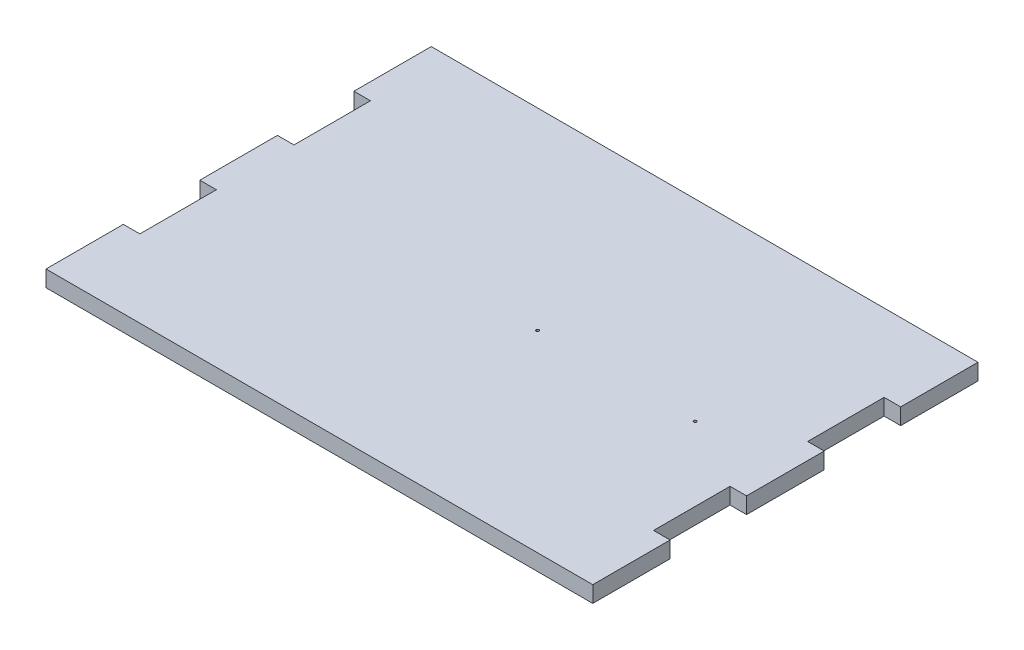
ISO-10303-21;
HEADER;
FILE_DESCRIPTION(('STEP AP214'),'2;1');
FILE_NAME('part.step','',(''),(''),'','','');
FILE_SCHEMA(('AUTOMOTIVE_DESIGN { 1 0 10303 214 1 1 1 1 }'));
ENDSEC;
DATA;
#1=APPLICATION_CONTEXT('core data for automotive mechanical design processes');
#2=APPLICATION_PROTOCOL_DEFINITION('international standard','automotive_design',2000,#1);
#3=PRODUCT_CONTEXT('',#1,'mechanical');
#4=PRODUCT('Part','Part','',(#3));
#5=PRODUCT_RELATED_PRODUCT_CATEGORY('part','',(#4));
#6=PRODUCT_DEFINITION_FORMATION('','',#4);
#7=PRODUCT_DEFINITION_CONTEXT('part definition',#1,'design');
#8=PRODUCT_DEFINITION('design','',#6,#7);
#9=PRODUCT_DEFINITION_SHAPE('','',#8);
#10=(LENGTH_UNIT() NAMED_UNIT(*) SI_UNIT(.MILLI.,.METRE.));
#11=(NAMED_UNIT(*) PLANE_ANGLE_UNIT() SI_UNIT($,.RADIAN.));
#12=(NAMED_UNIT(*) SI_UNIT($,.STERADIAN.) SOLID_ANGLE_UNIT());
#13=UNCERTAINTY_MEASURE_WITH_UNIT(LENGTH_MEASURE(1.E-05),#10,'distance_accuracy_value','');
#14=(GEOMETRIC_REPRESENTATION_CONTEXT(3) GLOBAL_UNCERTAINTY_ASSIGNED_CONTEXT((#13)) GLOBAL_UNIT_ASSIGNED_CONTEXT((#10,
#11,#12)) REPRESENTATION_CONTEXT('',''));
#15=CARTESIAN_POINT('',(0.,0.,0.));
#16=DIRECTION('',(0.,0.,1.));
#17=DIRECTION('',(1.,0.,0.));
#18=AXIS2_PLACEMENT_3D('',#15,#16,#17);
#19=CARTESIAN_POINT('',(-6.,5.7,14.));
#20=DIRECTION('',(0.,0.,-1.));
#21=DIRECTION('',(-1.,0.,0.));
#22=AXIS2_PLACEMENT_3D('',#19,#20,#21);
#23=PLANE('',#22);
#24=DIRECTION('',(0.,-1.,0.));
#25=VECTOR('',#24,1.);
#26=CARTESIAN_POINT('',(185.8,22.,14.));
#27=LINE('',#26,#25);
#28=CARTESIAN_POINT('',(185.8,5.7,14.));
#29=VERTEX_POINT('',#28);
#30=CARTESIAN_POINT('',(185.8,0.,14.));
#31=VERTEX_POINT('',#30);
#32=EDGE_CURVE('E49',#29,#31,#27,.T.);
#33=ORIENTED_EDGE('',*,*,#32,.F.);
#34=DIRECTION('',(1.,0.,0.));
#35=VECTOR('',#34,1.);
#36=CARTESIAN_POINT('',(-6.,5.7,14.));
#37=LINE('',#36,#35);
#38=CARTESIAN_POINT('',(-5.8,5.7,14.));
#39=VERTEX_POINT('',#38);
#40=EDGE_CURVE('E41',#39,#29,#37,.T.);
#41=ORIENTED_EDGE('',*,*,#40,.F.);
#42=DIRECTION('',(0.,-1.,0.));
#43=VECTOR('',#42,1.);
#44=CARTESIAN_POINT('',(-5.8,22.,14.));
#45=LINE('',#44,#43);
#46=CARTESIAN_POINT('',(-5.8,0.,14.));
#47=VERTEX_POINT('',#46);
#48=EDGE_CURVE('E230',#39,#47,#45,.T.);
#49=ORIENTED_EDGE('',*,*,#48,.T.);
#50=DIRECTION('',(1.,0.,0.));
#51=VECTOR('',#50,1.);
#52=CARTESIAN_POINT('',(-6.,0.,14.));
#53=LINE('',#52,#51);
#54=EDGE_CURVE('E191',#47,#31,#53,.T.);
#55=ORIENTED_EDGE('',*,*,#54,.T.);
#56=EDGE_LOOP('',(#33,#41,#49,#55));
#57=FACE_BOUND('',#56,.T.);
#58=ADVANCED_FACE('F33',(#57),#23,.F.);
#59=CARTESIAN_POINT('',(-6.,5.7,-121.));
#60=DIRECTION('',(0.,0.,1.));
#61=DIRECTION('',(1.,0.,0.));
#62=AXIS2_PLACEMENT_3D('',#59,#60,#61);
#63=PLANE('',#62);
#64=DIRECTION('',(0.,-1.,0.));
#65=VECTOR('',#64,1.);
#66=CARTESIAN_POINT('',(185.8,22.,-121.));
#67=LINE('',#66,#65);
#68=CARTESIAN_POINT('',(185.8,5.7,-121.));
#69=VERTEX_POINT('',#68);
#70=CARTESIAN_POINT('',(185.8,0.,-121.));
#71=VERTEX_POINT('',#70);
#72=EDGE_CURVE('E173',#69,#71,#67,.T.);
#73=ORIENTED_EDGE('',*,*,#72,.T.);
#74=DIRECTION('',(-1.,0.,0.));
#75=VECTOR('',#74,1.);
#76=CARTESIAN_POINT('',(-6.,0.,-121.));
#77=LINE('',#76,#75);
#78=CARTESIAN_POINT('',(-5.8,0.,-121.));
#79=VERTEX_POINT('',#78);
#80=EDGE_CURVE('E36',#71,#79,#77,.T.);
#81=ORIENTED_EDGE('',*,*,#80,.T.);
#82=DIRECTION('',(0.,-1.,0.));
#83=VECTOR('',#82,1.);
#84=CARTESIAN_POINT('',(-5.8,22.,-121.));
#85=LINE('',#84,#83);
#86=CARTESIAN_POINT('',(-5.8,5.7,-121.));
#87=VERTEX_POINT('',#86);
#88=EDGE_CURVE('E248',#87,#79,#85,.T.);
#89=ORIENTED_EDGE('',*,*,#88,.F.);
#90=DIRECTION('',(-1.,0.,0.));
#91=VECTOR('',#90,1.);
#92=CARTESIAN_POINT('',(-6.,5.7,-121.));
#93=LINE('',#92,#91);
#94=EDGE_CURVE('E11',#69,#87,#93,.T.);
#95=ORIENTED_EDGE('',*,*,#94,.F.);
#96=EDGE_LOOP('',(#73,#81,#89,#95));
#97=FACE_BOUND('',#96,.T.);
#98=ADVANCED_FACE('F183',(#97),#63,.F.);
#99=CARTESIAN_POINT('',(0.,5.7,0.));
#100=DIRECTION('',(0.,-1.,0.));
#101=DIRECTION('',(0.,0.,-1.));
#102=AXIS2_PLACEMENT_3D('',#99,#100,#101);
#103=PLANE('',#102);
#104=CARTESIAN_POINT('',(154.2,5.7,-53.5));
#105=DIRECTION('',(0.,-1.,0.));
#106=DIRECTION('',(0.,0.,-1.));
#107=AXIS2_PLACEMENT_3D('',#104,#105,#106);
#108=CIRCLE('',#107,0.499999999999999);
#109=CARTESIAN_POINT('',(154.2,5.7,-54.));
#110=VERTEX_POINT('',#109);
#111=EDGE_CURVE('E205',#110,#110,#108,.F.);
#112=ORIENTED_EDGE('',*,*,#111,.F.);
#113=EDGE_LOOP('',(#112));
#114=FACE_BOUND('',#113,.T.);
#115=CARTESIAN_POINT('',(99.,5.7,-53.5));
#116=DIRECTION('',(0.,-1.,0.));
#117=DIRECTION('',(0.,0.,-1.));
#118=AXIS2_PLACEMENT_3D('',#115,#116,#117);
#119=CIRCLE('',#118,0.499999999999999);
#120=CARTESIAN_POINT('',(99.,5.7,-54.));
#121=VERTEX_POINT('',#120);
#122=EDGE_CURVE('E195',#121,#121,#119,.F.);
#123=ORIENTED_EDGE('',*,*,#122,.F.);
#124=EDGE_LOOP('',(#123));
#125=FACE_BOUND('',#124,.T.);
#126=DIRECTION('',(0.,0.,1.));
#127=VECTOR('',#126,1.);
#128=CARTESIAN_POINT('',(185.8,5.7,0.));
#129=LINE('',#128,#127);
#130=CARTESIAN_POINT('',(185.8,5.7,-93.9));
#131=VERTEX_POINT('',#130);
#132=EDGE_CURVE('E274',#69,#131,#129,.T.);
#133=ORIENTED_EDGE('',*,*,#132,.F.);
#134=ORIENTED_EDGE('',*,*,#94,.T.);
#135=DIRECTION('',(0.,0.,-1.));
#136=VECTOR('',#135,1.);
#137=CARTESIAN_POINT('',(-5.8,5.7,0.));
#138=LINE('',#137,#136);
#139=CARTESIAN_POINT('',(-5.8,5.7,-93.9));
#140=VERTEX_POINT('',#139);
#141=EDGE_CURVE('E227',#140,#87,#138,.T.);
#142=ORIENTED_EDGE('',*,*,#141,.F.);
#143=DIRECTION('',(-1.,0.,0.));
#144=VECTOR('',#143,1.);
#145=CARTESIAN_POINT('',(0.,5.7,-93.9));
#146=LINE('',#145,#144);
#147=CARTESIAN_POINT('',(0.,5.7,-93.9));
#148=VERTEX_POINT('',#147);
#149=EDGE_CURVE('E225',#148,#140,#146,.T.);
#150=ORIENTED_EDGE('',*,*,#149,.F.);
#151=DIRECTION('',(0.,0.,-1.));
#152=VECTOR('',#151,1.);
#153=CARTESIAN_POINT('',(0.,5.7,0.));
#154=LINE('',#153,#152);
#155=CARTESIAN_POINT('',(0.,5.7,-67.1));
#156=VERTEX_POINT('',#155);
#157=EDGE_CURVE('E223',#156,#148,#154,.T.);
#158=ORIENTED_EDGE('',*,*,#157,.F.);
#159=DIRECTION('',(1.,0.,0.));
#160=VECTOR('',#159,1.);
#161=CARTESIAN_POINT('',(0.,5.7,-67.1));
#162=LINE('',#161,#160);
#163=CARTESIAN_POINT('',(-5.8,5.7,-67.1));
#164=VERTEX_POINT('',#163);
#165=EDGE_CURVE('E221',#164,#156,#162,.T.);
#166=ORIENTED_EDGE('',*,*,#165,.F.);
#167=DIRECTION('',(0.,0.,-1.));
#168=VECTOR('',#167,1.);
#169=CARTESIAN_POINT('',(-5.8,5.7,0.));
#170=LINE('',#169,#168);
#171=CARTESIAN_POINT('',(-5.8,5.7,-39.9));
#172=VERTEX_POINT('',#171);
#173=EDGE_CURVE('E219',#172,#164,#170,.T.);
#174=ORIENTED_EDGE('',*,*,#173,.F.);
#175=DIRECTION('',(-1.,0.,0.));
#176=VECTOR('',#175,1.);
#177=CARTESIAN_POINT('',(0.,5.7,-39.9));
#178=LINE('',#177,#176);
#179=CARTESIAN_POINT('',(0.,5.7,-39.9));
#180=VERTEX_POINT('',#179);
#181=EDGE_CURVE('E217',#180,#172,#178,.T.);
#182=ORIENTED_EDGE('',*,*,#181,.F.);
#183=DIRECTION('',(0.,0.,-1.));
#184=VECTOR('',#183,1.);
#185=CARTESIAN_POINT('',(0.,5.7,0.));
#186=LINE('',#185,#184);
#187=CARTESIAN_POINT('',(0.,5.7,-13.1));
#188=VERTEX_POINT('',#187);
#189=EDGE_CURVE('E215',#188,#180,#186,.T.);
#190=ORIENTED_EDGE('',*,*,#189,.F.);
#191=DIRECTION('',(1.,0.,0.));
#192=VECTOR('',#191,1.);
#193=CARTESIAN_POINT('',(0.,5.7,-13.1));
#194=LINE('',#193,#192);
#195=CARTESIAN_POINT('',(-5.8,5.7,-13.1));
#196=VERTEX_POINT('',#195);
#197=EDGE_CURVE('E213',#196,#188,#194,.T.);
#198=ORIENTED_EDGE('',*,*,#197,.F.);
#199=DIRECTION('',(0.,0.,-1.));
#200=VECTOR('',#199,1.);
#201=CARTESIAN_POINT('',(-5.8,5.7,0.));
#202=LINE('',#201,#200);
#203=EDGE_CURVE('E211',#39,#196,#202,.T.);
#204=ORIENTED_EDGE('',*,*,#203,.F.);
#205=ORIENTED_EDGE('',*,*,#40,.T.);
#206=DIRECTION('',(0.,0.,1.));
#207=VECTOR('',#206,1.);
#208=CARTESIAN_POINT('',(185.8,5.7,0.));
#209=LINE('',#208,#207);
#210=CARTESIAN_POINT('',(185.8,5.7,-13.1));
#211=VERTEX_POINT('',#210);
#212=EDGE_CURVE('E184',#211,#29,#209,.T.);
#213=ORIENTED_EDGE('',*,*,#212,.F.);
#214=DIRECTION('',(1.,0.,0.));
#215=VECTOR('',#214,1.);
#216=CARTESIAN_POINT('',(0.,5.7,-13.1));
#217=LINE('',#216,#215);
#218=CARTESIAN_POINT('',(180.,5.7,-13.1));
#219=VERTEX_POINT('',#218);
#220=EDGE_CURVE('E288',#219,#211,#217,.T.);
#221=ORIENTED_EDGE('',*,*,#220,.F.);
#222=DIRECTION('',(0.,0.,1.));
#223=VECTOR('',#222,1.);
#224=CARTESIAN_POINT('',(180.,5.7,0.));
#225=LINE('',#224,#223);
#226=CARTESIAN_POINT('',(180.,5.7,-39.9));
#227=VERTEX_POINT('',#226);
#228=EDGE_CURVE('E286',#227,#219,#225,.T.);
#229=ORIENTED_EDGE('',*,*,#228,.F.);
#230=DIRECTION('',(-1.,0.,0.));
#231=VECTOR('',#230,1.);
#232=CARTESIAN_POINT('',(0.,5.7,-39.9));
#233=LINE('',#232,#231);
#234=CARTESIAN_POINT('',(185.8,5.7,-39.9));
#235=VERTEX_POINT('',#234);
#236=EDGE_CURVE('E284',#235,#227,#233,.T.);
#237=ORIENTED_EDGE('',*,*,#236,.F.);
#238=DIRECTION('',(0.,0.,1.));
#239=VECTOR('',#238,1.);
#240=CARTESIAN_POINT('',(185.8,5.7,0.));
#241=LINE('',#240,#239);
#242=CARTESIAN_POINT('',(185.8,5.7,-67.1));
#243=VERTEX_POINT('',#242);
#244=EDGE_CURVE('E282',#243,#235,#241,.T.);
#245=ORIENTED_EDGE('',*,*,#244,.F.);
#246=DIRECTION('',(1.,0.,0.));
#247=VECTOR('',#246,1.);
#248=CARTESIAN_POINT('',(0.,5.7,-67.1));
#249=LINE('',#248,#247);
#250=CARTESIAN_POINT('',(180.,5.7,-67.1));
#251=VERTEX_POINT('',#250);
#252=EDGE_CURVE('E280',#251,#243,#249,.T.);
#253=ORIENTED_EDGE('',*,*,#252,.F.);
#254=DIRECTION('',(0.,0.,1.));
#255=VECTOR('',#254,1.);
#256=CARTESIAN_POINT('',(180.,5.7,-1.86418045179597E-13));
#257=LINE('',#256,#255);
#258=CARTESIAN_POINT('',(180.,5.7,-93.9));
#259=VERTEX_POINT('',#258);
#260=EDGE_CURVE('E278',#259,#251,#257,.T.);
#261=ORIENTED_EDGE('',*,*,#260,.F.);
#262=DIRECTION('',(-1.,0.,0.));
#263=VECTOR('',#262,1.);
#264=CARTESIAN_POINT('',(0.,5.7,-93.9));
#265=LINE('',#264,#263);
#266=EDGE_CURVE('E276',#131,#259,#265,.T.);
#267=ORIENTED_EDGE('',*,*,#266,.F.);
#268=EDGE_LOOP('',(#133,#134,#142,#150,#158,#166,#174,#182,#190,#198,#204,#205,#213,#221,#229,
#237,#245,#253,#261,#267));
#269=FACE_BOUND('',#268,.T.);
#270=ADVANCED_FACE('F373',(#114,#125,#269),#103,.F.);
#271=CARTESIAN_POINT('',(0.,0.,0.));
#272=DIRECTION('',(0.,-1.,0.));
#273=DIRECTION('',(0.,0.,-1.));
#274=AXIS2_PLACEMENT_3D('',#271,#272,#273);
#275=PLANE('',#274);
#276=CARTESIAN_POINT('',(154.2,0.,-53.5));
#277=DIRECTION('',(0.,1.,0.));
#278=DIRECTION('',(0.,0.,1.));
#279=AXIS2_PLACEMENT_3D('',#276,#277,#278);
#280=CIRCLE('',#279,0.499999999999999);
#281=CARTESIAN_POINT('',(154.2,0.,-53.));
#282=VERTEX_POINT('',#281);
#283=EDGE_CURVE('E208',#282,#282,#280,.T.);
#284=ORIENTED_EDGE('',*,*,#283,.T.);
#285=EDGE_LOOP('',(#284));
#286=FACE_BOUND('',#285,.T.);
#287=CARTESIAN_POINT('',(99.,0.,-53.5));
#288=DIRECTION('',(0.,1.,0.));
#289=DIRECTION('',(0.,0.,1.));
#290=AXIS2_PLACEMENT_3D('',#287,#288,#289);
#291=CIRCLE('',#290,0.499999999999999);
#292=CARTESIAN_POINT('',(99.,0.,-53.));
#293=VERTEX_POINT('',#292);
#294=EDGE_CURVE('E200',#293,#293,#291,.T.);
#295=ORIENTED_EDGE('',*,*,#294,.T.);
#296=EDGE_LOOP('',(#295));
#297=FACE_BOUND('',#296,.T.);
#298=ORIENTED_EDGE('',*,*,#80,.F.);
#299=DIRECTION('',(0.,0.,1.));
#300=VECTOR('',#299,1.);
#301=CARTESIAN_POINT('',(185.8,0.,-121.));
#302=LINE('',#301,#300);
#303=CARTESIAN_POINT('',(185.8,0.,-93.9));
#304=VERTEX_POINT('',#303);
#305=EDGE_CURVE('E171',#71,#304,#302,.T.);
#306=ORIENTED_EDGE('',*,*,#305,.T.);
#307=DIRECTION('',(-1.,0.,0.));
#308=VECTOR('',#307,1.);
#309=CARTESIAN_POINT('',(185.8,0.,-93.9));
#310=LINE('',#309,#308);
#311=CARTESIAN_POINT('',(180.,0.,-93.9));
#312=VERTEX_POINT('',#311);
#313=EDGE_CURVE('E180',#304,#312,#310,.T.);
#314=ORIENTED_EDGE('',*,*,#313,.T.);
#315=DIRECTION('',(0.,0.,1.));
#316=VECTOR('',#315,1.);
#317=CARTESIAN_POINT('',(180.,0.,-93.9));
#318=LINE('',#317,#316);
#319=CARTESIAN_POINT('',(180.,0.,-67.1));
#320=VERTEX_POINT('',#319);
#321=EDGE_CURVE('E324',#312,#320,#318,.T.);
#322=ORIENTED_EDGE('',*,*,#321,.T.);
#323=DIRECTION('',(1.,0.,0.));
#324=VECTOR('',#323,1.);
#325=CARTESIAN_POINT('',(180.,0.,-67.1));
#326=LINE('',#325,#324);
#327=CARTESIAN_POINT('',(185.8,0.,-67.1));
#328=VERTEX_POINT('',#327);
#329=EDGE_CURVE('E321',#320,#328,#326,.T.);
#330=ORIENTED_EDGE('',*,*,#329,.T.);
#331=DIRECTION('',(0.,0.,1.));
#332=VECTOR('',#331,1.);
#333=CARTESIAN_POINT('',(185.8,0.,-67.1));
#334=LINE('',#333,#332);
#335=CARTESIAN_POINT('',(185.8,0.,-39.9));
#336=VERTEX_POINT('',#335);
#337=EDGE_CURVE('E318',#328,#336,#334,.T.);
#338=ORIENTED_EDGE('',*,*,#337,.T.);
#339=DIRECTION('',(-1.,0.,0.));
#340=VECTOR('',#339,1.);
#341=CARTESIAN_POINT('',(185.8,0.,-39.9));
#342=LINE('',#341,#340);
#343=CARTESIAN_POINT('',(180.,0.,-39.9));
#344=VERTEX_POINT('',#343);
#345=EDGE_CURVE('E315',#336,#344,#342,.T.);
#346=ORIENTED_EDGE('',*,*,#345,.T.);
#347=DIRECTION('',(0.,0.,1.));
#348=VECTOR('',#347,1.);
#349=CARTESIAN_POINT('',(180.,0.,-39.9));
#350=LINE('',#349,#348);
#351=CARTESIAN_POINT('',(180.,0.,-13.1));
#352=VERTEX_POINT('',#351);
#353=EDGE_CURVE('E312',#344,#352,#350,.T.);
#354=ORIENTED_EDGE('',*,*,#353,.T.);
#355=DIRECTION('',(1.,0.,0.));
#356=VECTOR('',#355,1.);
#357=CARTESIAN_POINT('',(180.,0.,-13.1));
#358=LINE('',#357,#356);
#359=CARTESIAN_POINT('',(185.8,0.,-13.1));
#360=VERTEX_POINT('',#359);
#361=EDGE_CURVE('E309',#352,#360,#358,.T.);
#362=ORIENTED_EDGE('',*,*,#361,.T.);
#363=DIRECTION('',(0.,0.,1.));
#364=VECTOR('',#363,1.);
#365=CARTESIAN_POINT('',(185.8,0.,-13.1));
#366=LINE('',#365,#364);
#367=EDGE_CURVE('E307',#360,#31,#366,.T.);
#368=ORIENTED_EDGE('',*,*,#367,.T.);
#369=ORIENTED_EDGE('',*,*,#54,.F.);
#370=DIRECTION('',(0.,0.,-1.));
#371=VECTOR('',#370,1.);
#372=CARTESIAN_POINT('',(-5.8,0.,-13.1));
#373=LINE('',#372,#371);
#374=CARTESIAN_POINT('',(-5.8,0.,-13.1));
#375=VERTEX_POINT('',#374);
#376=EDGE_CURVE('E271',#47,#375,#373,.T.);
#377=ORIENTED_EDGE('',*,*,#376,.T.);
#378=DIRECTION('',(1.,0.,0.));
#379=VECTOR('',#378,1.);
#380=CARTESIAN_POINT('',(0.,0.,-13.1));
#381=LINE('',#380,#379);
#382=CARTESIAN_POINT('',(0.,0.,-13.1));
#383=VERTEX_POINT('',#382);
#384=EDGE_CURVE('E268',#375,#383,#381,.T.);
#385=ORIENTED_EDGE('',*,*,#384,.T.);
#386=DIRECTION('',(0.,0.,-1.));
#387=VECTOR('',#386,1.);
#388=CARTESIAN_POINT('',(0.,0.,-39.9));
#389=LINE('',#388,#387);
#390=CARTESIAN_POINT('',(0.,0.,-39.9));
#391=VERTEX_POINT('',#390);
#392=EDGE_CURVE('E265',#383,#391,#389,.T.);
#393=ORIENTED_EDGE('',*,*,#392,.T.);
#394=DIRECTION('',(-1.,0.,0.));
#395=VECTOR('',#394,1.);
#396=CARTESIAN_POINT('',(-5.8,0.,-39.9));
#397=LINE('',#396,#395);
#398=CARTESIAN_POINT('',(-5.8,0.,-39.9));
#399=VERTEX_POINT('',#398);
#400=EDGE_CURVE('E262',#391,#399,#397,.T.);
#401=ORIENTED_EDGE('',*,*,#400,.T.);
#402=DIRECTION('',(0.,0.,-1.));
#403=VECTOR('',#402,1.);
#404=CARTESIAN_POINT('',(-5.8,0.,-67.1));
#405=LINE('',#404,#403);
#406=CARTESIAN_POINT('',(-5.8,0.,-67.1));
#407=VERTEX_POINT('',#406);
#408=EDGE_CURVE('E259',#399,#407,#405,.T.);
#409=ORIENTED_EDGE('',*,*,#408,.T.);
#410=DIRECTION('',(1.,0.,0.));
#411=VECTOR('',#410,1.);
#412=CARTESIAN_POINT('',(0.,0.,-67.1));
#413=LINE('',#412,#411);
#414=CARTESIAN_POINT('',(0.,0.,-67.1));
#415=VERTEX_POINT('',#414);
#416=EDGE_CURVE('E256',#407,#415,#413,.T.);
#417=ORIENTED_EDGE('',*,*,#416,.T.);
#418=DIRECTION('',(0.,0.,-1.));
#419=VECTOR('',#418,1.);
#420=CARTESIAN_POINT('',(0.,0.,-93.9));
#421=LINE('',#420,#419);
#422=CARTESIAN_POINT('',(0.,0.,-93.9));
#423=VERTEX_POINT('',#422);
#424=EDGE_CURVE('E253',#415,#423,#421,.T.);
#425=ORIENTED_EDGE('',*,*,#424,.T.);
#426=DIRECTION('',(-1.,0.,0.));
#427=VECTOR('',#426,1.);
#428=CARTESIAN_POINT('',(-5.8,0.,-93.9));
#429=LINE('',#428,#427);
#430=CARTESIAN_POINT('',(-5.8,0.,-93.9));
#431=VERTEX_POINT('',#430);
#432=EDGE_CURVE('E251',#423,#431,#429,.T.);
#433=ORIENTED_EDGE('',*,*,#432,.T.);
#434=DIRECTION('',(0.,0.,-1.));
#435=VECTOR('',#434,1.);
#436=CARTESIAN_POINT('',(-5.8,0.,-121.));
#437=LINE('',#436,#435);
#438=EDGE_CURVE('E190',#431,#79,#437,.T.);
#439=ORIENTED_EDGE('',*,*,#438,.T.);
#440=EDGE_LOOP('',(#298,#306,#314,#322,#330,#338,#346,#354,#362,#368,#369,#377,#385,#393,#401,
#409,#417,#425,#433,#439));
#441=FACE_BOUND('',#440,.T.);
#442=ADVANCED_FACE('F187',(#286,#297,#441),#275,.T.);
#443=CARTESIAN_POINT('',(99.,33.,-53.5));
#444=DIRECTION('',(0.,-1.,0.));
#445=DIRECTION('',(0.,0.,-1.));
#446=AXIS2_PLACEMENT_3D('',#443,#444,#445);
#447=CYLINDRICAL_SURFACE('',#446,0.499999999999999);
#448=ORIENTED_EDGE('',*,*,#294,.F.);
#449=EDGE_LOOP('',(#448));
#450=FACE_BOUND('',#449,.T.);
#451=ORIENTED_EDGE('',*,*,#122,.T.);
#452=EDGE_LOOP('',(#451));
#453=FACE_BOUND('',#452,.T.);
#454=ADVANCED_FACE('F445',(#450,#453),#447,.F.);
#455=CARTESIAN_POINT('',(154.2,33.,-53.5));
#456=DIRECTION('',(0.,-1.,0.));
#457=DIRECTION('',(0.,0.,-1.));
#458=AXIS2_PLACEMENT_3D('',#455,#456,#457);
#459=CYLINDRICAL_SURFACE('',#458,0.499999999999999);
#460=ORIENTED_EDGE('',*,*,#283,.F.);
#461=EDGE_LOOP('',(#460));
#462=FACE_BOUND('',#461,.T.);
#463=ORIENTED_EDGE('',*,*,#111,.T.);
#464=EDGE_LOOP('',(#463));
#465=FACE_BOUND('',#464,.T.);
#466=ADVANCED_FACE('F442',(#462,#465),#459,.F.);
#467=CARTESIAN_POINT('',(-5.8,22.,-13.1));
#468=DIRECTION('',(-1.,0.,0.));
#469=DIRECTION('',(0.,0.,1.));
#470=AXIS2_PLACEMENT_3D('',#467,#468,#469);
#471=PLANE('',#470);
#472=ORIENTED_EDGE('',*,*,#203,.T.);
#473=DIRECTION('',(0.,-1.,0.));
#474=VECTOR('',#473,1.);
#475=CARTESIAN_POINT('',(-5.8,22.,-13.1));
#476=LINE('',#475,#474);
#477=EDGE_CURVE('E232',#196,#375,#476,.T.);
#478=ORIENTED_EDGE('',*,*,#477,.T.);
#479=ORIENTED_EDGE('',*,*,#376,.F.);
#480=ORIENTED_EDGE('',*,*,#48,.F.);
#481=EDGE_LOOP('',(#472,#478,#479,#480));
#482=FACE_BOUND('',#481,.T.);
#483=ADVANCED_FACE('F381',(#482),#471,.T.);
#484=CARTESIAN_POINT('',(0.,22.,-13.1));
#485=DIRECTION('',(0.,0.,-1.));
#486=DIRECTION('',(-1.,0.,0.));
#487=AXIS2_PLACEMENT_3D('',#484,#485,#486);
#488=PLANE('',#487);
#489=ORIENTED_EDGE('',*,*,#197,.T.);
#490=DIRECTION('',(0.,-1.,0.));
#491=VECTOR('',#490,1.);
#492=CARTESIAN_POINT('',(0.,22.,-13.1));
#493=LINE('',#492,#491);
#494=EDGE_CURVE('E234',#188,#383,#493,.T.);
#495=ORIENTED_EDGE('',*,*,#494,.T.);
#496=ORIENTED_EDGE('',*,*,#384,.F.);
#497=ORIENTED_EDGE('',*,*,#477,.F.);
#498=EDGE_LOOP('',(#489,#495,#496,#497));
#499=FACE_BOUND('',#498,.T.);
#500=ADVANCED_FACE('F384',(#499),#488,.T.);
#501=CARTESIAN_POINT('',(0.,22.,-39.9));
#502=DIRECTION('',(-1.,0.,0.));
#503=DIRECTION('',(0.,0.,1.));
#504=AXIS2_PLACEMENT_3D('',#501,#502,#503);
#505=PLANE('',#504);
#506=ORIENTED_EDGE('',*,*,#189,.T.);
#507=DIRECTION('',(0.,-1.,0.));
#508=VECTOR('',#507,1.);
#509=CARTESIAN_POINT('',(0.,22.,-39.9));
#510=LINE('',#509,#508);
#511=EDGE_CURVE('E236',#180,#391,#510,.T.);
#512=ORIENTED_EDGE('',*,*,#511,.T.);
#513=ORIENTED_EDGE('',*,*,#392,.F.);
#514=ORIENTED_EDGE('',*,*,#494,.F.);
#515=EDGE_LOOP('',(#506,#512,#513,#514));
#516=FACE_BOUND('',#515,.T.);
#517=ADVANCED_FACE('F389',(#516),#505,.T.);
#518=CARTESIAN_POINT('',(-5.8,22.,-39.9));
#519=DIRECTION('',(0.,0.,1.));
#520=DIRECTION('',(1.,0.,0.));
#521=AXIS2_PLACEMENT_3D('',#518,#519,#520);
#522=PLANE('',#521);
#523=ORIENTED_EDGE('',*,*,#181,.T.);
#524=DIRECTION('',(0.,-1.,0.));
#525=VECTOR('',#524,1.);
#526=CARTESIAN_POINT('',(-5.8,22.,-39.9));
#527=LINE('',#526,#525);
#528=EDGE_CURVE('E238',#172,#399,#527,.T.);
#529=ORIENTED_EDGE('',*,*,#528,.T.);
#530=ORIENTED_EDGE('',*,*,#400,.F.);
#531=ORIENTED_EDGE('',*,*,#511,.F.);
#532=EDGE_LOOP('',(#523,#529,#530,#531));
#533=FACE_BOUND('',#532,.T.);
#534=ADVANCED_FACE('F393',(#533),#522,.T.);
#535=CARTESIAN_POINT('',(-5.8,22.,-67.1));
#536=DIRECTION('',(-1.,0.,0.));
#537=DIRECTION('',(0.,0.,1.));
#538=AXIS2_PLACEMENT_3D('',#535,#536,#537);
#539=PLANE('',#538);
#540=ORIENTED_EDGE('',*,*,#173,.T.);
#541=DIRECTION('',(0.,-1.,0.));
#542=VECTOR('',#541,1.);
#543=CARTESIAN_POINT('',(-5.8,22.,-67.1));
#544=LINE('',#543,#542);
#545=EDGE_CURVE('E240',#164,#407,#544,.T.);
#546=ORIENTED_EDGE('',*,*,#545,.T.);
#547=ORIENTED_EDGE('',*,*,#408,.F.);
#548=ORIENTED_EDGE('',*,*,#528,.F.);
#549=EDGE_LOOP('',(#540,#546,#547,#548));
#550=FACE_BOUND('',#549,.T.);
#551=ADVANCED_FACE('F398',(#550),#539,.T.);
#552=CARTESIAN_POINT('',(0.,22.,-67.1));
#553=DIRECTION('',(0.,0.,-1.));
#554=DIRECTION('',(-1.,0.,0.));
#555=AXIS2_PLACEMENT_3D('',#552,#553,#554);
#556=PLANE('',#555);
#557=ORIENTED_EDGE('',*,*,#165,.T.);
#558=DIRECTION('',(0.,-1.,0.));
#559=VECTOR('',#558,1.);
#560=CARTESIAN_POINT('',(0.,22.,-67.1));
#561=LINE('',#560,#559);
#562=EDGE_CURVE('E242',#156,#415,#561,.T.);
#563=ORIENTED_EDGE('',*,*,#562,.T.);
#564=ORIENTED_EDGE('',*,*,#416,.F.);
#565=ORIENTED_EDGE('',*,*,#545,.F.);
#566=EDGE_LOOP('',(#557,#563,#564,#565));
#567=FACE_BOUND('',#566,.T.);
#568=ADVANCED_FACE('F403',(#567),#556,.T.);
#569=CARTESIAN_POINT('',(0.,22.,-93.9));
#570=DIRECTION('',(-1.,0.,0.));
#571=DIRECTION('',(0.,0.,1.));
#572=AXIS2_PLACEMENT_3D('',#569,#570,#571);
#573=PLANE('',#572);
#574=ORIENTED_EDGE('',*,*,#157,.T.);
#575=DIRECTION('',(0.,-1.,0.));
#576=VECTOR('',#575,1.);
#577=CARTESIAN_POINT('',(0.,22.,-93.9));
#578=LINE('',#577,#576);
#579=EDGE_CURVE('E244',#148,#423,#578,.T.);
#580=ORIENTED_EDGE('',*,*,#579,.T.);
#581=ORIENTED_EDGE('',*,*,#424,.F.);
#582=ORIENTED_EDGE('',*,*,#562,.F.);
#583=EDGE_LOOP('',(#574,#580,#581,#582));
#584=FACE_BOUND('',#583,.T.);
#585=ADVANCED_FACE('F408',(#584),#573,.T.);
#586=CARTESIAN_POINT('',(-5.8,22.,-93.9));
#587=DIRECTION('',(0.,0.,1.));
#588=DIRECTION('',(1.,0.,0.));
#589=AXIS2_PLACEMENT_3D('',#586,#587,#588);
#590=PLANE('',#589);
#591=ORIENTED_EDGE('',*,*,#149,.T.);
#592=DIRECTION('',(0.,-1.,0.));
#593=VECTOR('',#592,1.);
#594=CARTESIAN_POINT('',(-5.8,22.,-93.9));
#595=LINE('',#594,#593);
#596=EDGE_CURVE('E246',#140,#431,#595,.T.);
#597=ORIENTED_EDGE('',*,*,#596,.T.);
#598=ORIENTED_EDGE('',*,*,#432,.F.);
#599=ORIENTED_EDGE('',*,*,#579,.F.);
#600=EDGE_LOOP('',(#591,#597,#598,#599));
#601=FACE_BOUND('',#600,.T.);
#602=ADVANCED_FACE('F413',(#601),#590,.T.);
#603=CARTESIAN_POINT('',(-5.8,22.,-121.));
#604=DIRECTION('',(-1.,0.,0.));
#605=DIRECTION('',(0.,0.,1.));
#606=AXIS2_PLACEMENT_3D('',#603,#604,#605);
#607=PLANE('',#606);
#608=ORIENTED_EDGE('',*,*,#141,.T.);
#609=ORIENTED_EDGE('',*,*,#88,.T.);
#610=ORIENTED_EDGE('',*,*,#438,.F.);
#611=ORIENTED_EDGE('',*,*,#596,.F.);
#612=EDGE_LOOP('',(#608,#609,#610,#611));
#613=FACE_BOUND('',#612,.T.);
#614=ADVANCED_FACE('F417',(#613),#607,.T.);
#615=CARTESIAN_POINT('',(185.8,22.,-121.));
#616=DIRECTION('',(1.,0.,0.));
#617=DIRECTION('',(0.,0.,-1.));
#618=AXIS2_PLACEMENT_3D('',#615,#616,#617);
#619=PLANE('',#618);
#620=ORIENTED_EDGE('',*,*,#132,.T.);
#621=DIRECTION('',(0.,-1.,0.));
#622=VECTOR('',#621,1.);
#623=CARTESIAN_POINT('',(185.8,22.,-93.9));
#624=LINE('',#623,#622);
#625=EDGE_CURVE('E176',#131,#304,#624,.T.);
#626=ORIENTED_EDGE('',*,*,#625,.T.);
#627=ORIENTED_EDGE('',*,*,#305,.F.);
#628=ORIENTED_EDGE('',*,*,#72,.F.);
#629=EDGE_LOOP('',(#620,#626,#627,#628));
#630=FACE_BOUND('',#629,.T.);
#631=ADVANCED_FACE('F172',(#630),#619,.T.);
#632=CARTESIAN_POINT('',(185.8,22.,-93.9));
#633=DIRECTION('',(0.,0.,1.));
#634=DIRECTION('',(1.,0.,0.));
#635=AXIS2_PLACEMENT_3D('',#632,#633,#634);
#636=PLANE('',#635);
#637=ORIENTED_EDGE('',*,*,#266,.T.);
#638=DIRECTION('',(0.,-1.,0.));
#639=VECTOR('',#638,1.);
#640=CARTESIAN_POINT('',(180.,22.,-93.9));
#641=LINE('',#640,#639);
#642=EDGE_CURVE('E292',#259,#312,#641,.T.);
#643=ORIENTED_EDGE('',*,*,#642,.T.);
#644=ORIENTED_EDGE('',*,*,#313,.F.);
#645=ORIENTED_EDGE('',*,*,#625,.F.);
#646=EDGE_LOOP('',(#637,#643,#644,#645));
#647=FACE_BOUND('',#646,.T.);
#648=ADVANCED_FACE('F329',(#647),#636,.T.);
#649=CARTESIAN_POINT('',(180.,22.,-93.9));
#650=DIRECTION('',(1.,0.,0.));
#651=DIRECTION('',(0.,0.,-1.));
#652=AXIS2_PLACEMENT_3D('',#649,#650,#651);
#653=PLANE('',#652);
#654=ORIENTED_EDGE('',*,*,#260,.T.);
#655=DIRECTION('',(0.,-1.,0.));
#656=VECTOR('',#655,1.);
#657=CARTESIAN_POINT('',(180.,22.,-67.1));
#658=LINE('',#657,#656);
#659=EDGE_CURVE('E294',#251,#320,#658,.T.);
#660=ORIENTED_EDGE('',*,*,#659,.T.);
#661=ORIENTED_EDGE('',*,*,#321,.F.);
#662=ORIENTED_EDGE('',*,*,#642,.F.);
#663=EDGE_LOOP('',(#654,#660,#661,#662));
#664=FACE_BOUND('',#663,.T.);
#665=ADVANCED_FACE('F334',(#664),#653,.T.);
#666=CARTESIAN_POINT('',(180.,22.,-67.1));
#667=DIRECTION('',(0.,0.,-1.));
#668=DIRECTION('',(-1.,0.,0.));
#669=AXIS2_PLACEMENT_3D('',#666,#667,#668);
#670=PLANE('',#669);
#671=ORIENTED_EDGE('',*,*,#252,.T.);
#672=DIRECTION('',(0.,-1.,0.));
#673=VECTOR('',#672,1.);
#674=CARTESIAN_POINT('',(185.8,22.,-67.1));
#675=LINE('',#674,#673);
#676=EDGE_CURVE('E296',#243,#328,#675,.T.);
#677=ORIENTED_EDGE('',*,*,#676,.T.);
#678=ORIENTED_EDGE('',*,*,#329,.F.);
#679=ORIENTED_EDGE('',*,*,#659,.F.);
#680=EDGE_LOOP('',(#671,#677,#678,#679));
#681=FACE_BOUND('',#680,.T.);
#682=ADVANCED_FACE('F339',(#681),#670,.T.);
#683=CARTESIAN_POINT('',(185.8,22.,-67.1));
#684=DIRECTION('',(1.,0.,0.));
#685=DIRECTION('',(0.,0.,-1.));
#686=AXIS2_PLACEMENT_3D('',#683,#684,#685);
#687=PLANE('',#686);
#688=ORIENTED_EDGE('',*,*,#244,.T.);
#689=DIRECTION('',(0.,-1.,0.));
#690=VECTOR('',#689,1.);
#691=CARTESIAN_POINT('',(185.8,22.,-39.9));
#692=LINE('',#691,#690);
#693=EDGE_CURVE('E298',#235,#336,#692,.T.);
#694=ORIENTED_EDGE('',*,*,#693,.T.);
#695=ORIENTED_EDGE('',*,*,#337,.F.);
#696=ORIENTED_EDGE('',*,*,#676,.F.);
#697=EDGE_LOOP('',(#688,#694,#695,#696));
#698=FACE_BOUND('',#697,.T.);
#699=ADVANCED_FACE('F344',(#698),#687,.T.);
#700=CARTESIAN_POINT('',(185.8,22.,-39.9));
#701=DIRECTION('',(0.,0.,1.));
#702=DIRECTION('',(1.,0.,0.));
#703=AXIS2_PLACEMENT_3D('',#700,#701,#702);
#704=PLANE('',#703);
#705=ORIENTED_EDGE('',*,*,#236,.T.);
#706=DIRECTION('',(0.,-1.,0.));
#707=VECTOR('',#706,1.);
#708=CARTESIAN_POINT('',(180.,22.,-39.9));
#709=LINE('',#708,#707);
#710=EDGE_CURVE('E300',#227,#344,#709,.T.);
#711=ORIENTED_EDGE('',*,*,#710,.T.);
#712=ORIENTED_EDGE('',*,*,#345,.F.);
#713=ORIENTED_EDGE('',*,*,#693,.F.);
#714=EDGE_LOOP('',(#705,#711,#712,#713));
#715=FACE_BOUND('',#714,.T.);
#716=ADVANCED_FACE('F349',(#715),#704,.T.);
#717=CARTESIAN_POINT('',(180.,22.,-39.9));
#718=DIRECTION('',(1.,0.,0.));
#719=DIRECTION('',(0.,0.,-1.));
#720=AXIS2_PLACEMENT_3D('',#717,#718,#719);
#721=PLANE('',#720);
#722=ORIENTED_EDGE('',*,*,#228,.T.);
#723=DIRECTION('',(0.,-1.,0.));
#724=VECTOR('',#723,1.);
#725=CARTESIAN_POINT('',(180.,22.,-13.1));
#726=LINE('',#725,#724);
#727=EDGE_CURVE('E302',#219,#352,#726,.T.);
#728=ORIENTED_EDGE('',*,*,#727,.T.);
#729=ORIENTED_EDGE('',*,*,#353,.F.);
#730=ORIENTED_EDGE('',*,*,#710,.F.);
#731=EDGE_LOOP('',(#722,#728,#729,#730));
#732=FACE_BOUND('',#731,.T.);
#733=ADVANCED_FACE('F354',(#732),#721,.T.);
#734=CARTESIAN_POINT('',(180.,22.,-13.1));
#735=DIRECTION('',(0.,0.,-1.));
#736=DIRECTION('',(-1.,0.,0.));
#737=AXIS2_PLACEMENT_3D('',#734,#735,#736);
#738=PLANE('',#737);
#739=ORIENTED_EDGE('',*,*,#220,.T.);
#740=DIRECTION('',(0.,-1.,0.));
#741=VECTOR('',#740,1.);
#742=CARTESIAN_POINT('',(185.8,22.,-13.1));
#743=LINE('',#742,#741);
#744=EDGE_CURVE('E304',#211,#360,#743,.T.);
#745=ORIENTED_EDGE('',*,*,#744,.T.);
#746=ORIENTED_EDGE('',*,*,#361,.F.);
#747=ORIENTED_EDGE('',*,*,#727,.F.);
#748=EDGE_LOOP('',(#739,#745,#746,#747));
#749=FACE_BOUND('',#748,.T.);
#750=ADVANCED_FACE('F358',(#749),#738,.T.);
#751=CARTESIAN_POINT('',(185.8,22.,-13.1));
#752=DIRECTION('',(1.,0.,0.));
#753=DIRECTION('',(0.,0.,-1.));
#754=AXIS2_PLACEMENT_3D('',#751,#752,#753);
#755=PLANE('',#754);
#756=ORIENTED_EDGE('',*,*,#212,.T.);
#757=ORIENTED_EDGE('',*,*,#32,.T.);
#758=ORIENTED_EDGE('',*,*,#367,.F.);
#759=ORIENTED_EDGE('',*,*,#744,.F.);
#760=EDGE_LOOP('',(#756,#757,#758,#759));
#761=FACE_BOUND('',#760,.T.);
#762=ADVANCED_FACE('F362',(#761),#755,.T.);
#763=CLOSED_SHELL('',(#58,#98,#270,#442,#454,#466,#483,#500,#517,#534,#551,#568,#585,#602,#614,
#631,#648,#665,#682,#699,#716,#733,#750,#762));
#764=MANIFOLD_SOLID_BREP('B2',#763);
#765=ADVANCED_BREP_SHAPE_REPRESENTATION('',(#18,#764),#14);
#766=SHAPE_DEFINITION_REPRESENTATION(#9,#765);
ENDSEC;
END-ISO-10303-21;
